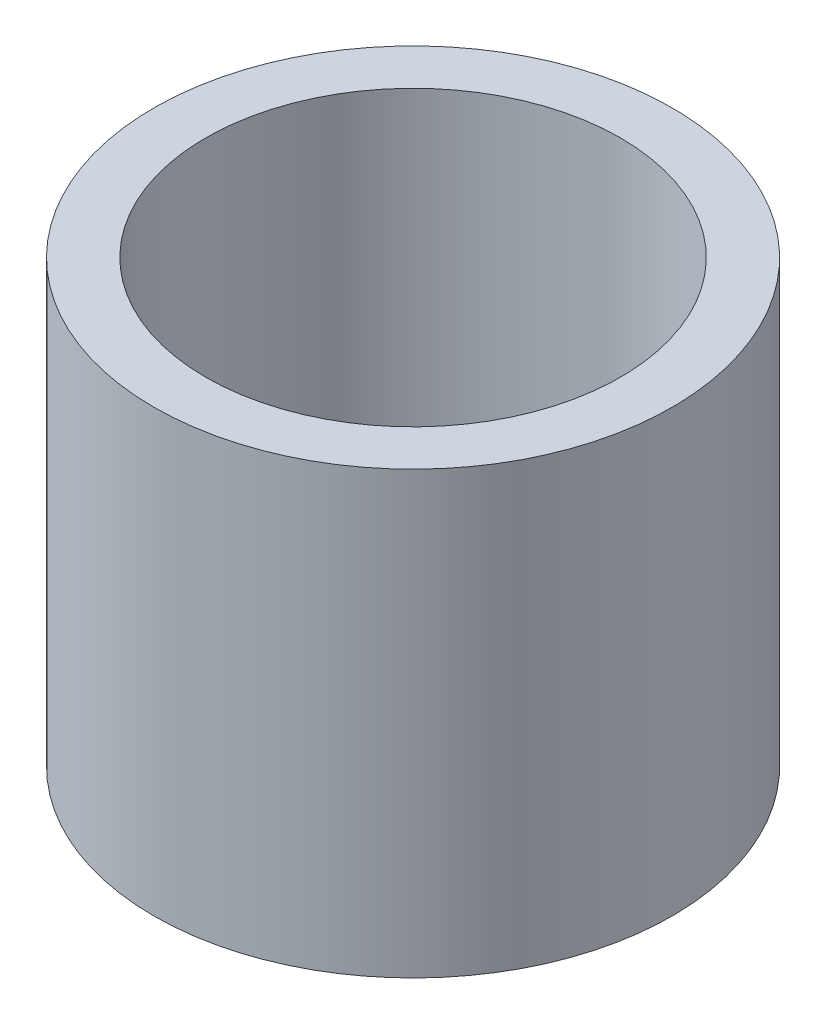
ISO-10303-21;
HEADER;
FILE_DESCRIPTION(('STEP AP214'),'2;1');
FILE_NAME('part.step','',(''),(''),'','','');
FILE_SCHEMA(('AUTOMOTIVE_DESIGN { 1 0 10303 214 1 1 1 1 }'));
ENDSEC;
DATA;
#1=APPLICATION_CONTEXT('core data for automotive mechanical design processes');
#2=APPLICATION_PROTOCOL_DEFINITION('international standard','automotive_design',2000,#1);
#3=PRODUCT_CONTEXT('',#1,'mechanical');
#4=PRODUCT('Part','Part','',(#3));
#5=PRODUCT_RELATED_PRODUCT_CATEGORY('part','',(#4));
#6=PRODUCT_DEFINITION_FORMATION('','',#4);
#7=PRODUCT_DEFINITION_CONTEXT('part definition',#1,'design');
#8=PRODUCT_DEFINITION('design','',#6,#7);
#9=PRODUCT_DEFINITION_SHAPE('','',#8);
#10=(LENGTH_UNIT() NAMED_UNIT(*) SI_UNIT(.MILLI.,.METRE.));
#11=(NAMED_UNIT(*) PLANE_ANGLE_UNIT() SI_UNIT($,.RADIAN.));
#12=(NAMED_UNIT(*) SI_UNIT($,.STERADIAN.) SOLID_ANGLE_UNIT());
#13=UNCERTAINTY_MEASURE_WITH_UNIT(LENGTH_MEASURE(1.E-05),#10,'distance_accuracy_value','');
#14=(GEOMETRIC_REPRESENTATION_CONTEXT(3) GLOBAL_UNCERTAINTY_ASSIGNED_CONTEXT((#13)) GLOBAL_UNIT_ASSIGNED_CONTEXT((#10,
#11,#12)) REPRESENTATION_CONTEXT('',''));
#15=CARTESIAN_POINT('',(0.,0.,0.));
#16=DIRECTION('',(0.,0.,1.));
#17=DIRECTION('',(1.,0.,0.));
#18=AXIS2_PLACEMENT_3D('',#15,#16,#17);
#19=CARTESIAN_POINT('',(0.,17.,0.));
#20=DIRECTION('',(0.,1.,0.));
#21=DIRECTION('',(0.,0.,1.));
#22=AXIS2_PLACEMENT_3D('',#19,#20,#21);
#23=PLANE('',#22);
#24=CARTESIAN_POINT('',(0.,17.,0.));
#25=DIRECTION('',(0.,1.,0.));
#26=DIRECTION('',(0.,0.,1.));
#27=AXIS2_PLACEMENT_3D('',#24,#25,#26);
#28=CIRCLE('',#27,20.);
#29=CARTESIAN_POINT('',(0.,17.,20.));
#30=VERTEX_POINT('',#29);
#31=EDGE_CURVE('E12',#30,#30,#28,.T.);
#32=ORIENTED_EDGE('',*,*,#31,.T.);
#33=EDGE_LOOP('',(#32));
#34=FACE_BOUND('',#33,.T.);
#35=CARTESIAN_POINT('',(0.,17.,0.));
#36=DIRECTION('',(0.,1.,0.));
#37=DIRECTION('',(0.,0.,1.));
#38=AXIS2_PLACEMENT_3D('',#35,#36,#37);
#39=CIRCLE('',#38,16.);
#40=CARTESIAN_POINT('',(0.,17.,16.));
#41=VERTEX_POINT('',#40);
#42=EDGE_CURVE('E58',#41,#41,#39,.T.);
#43=ORIENTED_EDGE('',*,*,#42,.F.);
#44=EDGE_LOOP('',(#43));
#45=FACE_BOUND('',#44,.T.);
#46=ADVANCED_FACE('F44',(#34,#45),#23,.T.);
#47=CARTESIAN_POINT('',(0.,-17.,0.));
#48=DIRECTION('',(0.,1.,0.));
#49=DIRECTION('',(0.,0.,1.));
#50=AXIS2_PLACEMENT_3D('',#47,#48,#49);
#51=PLANE('',#50);
#52=CARTESIAN_POINT('',(0.,-17.,0.));
#53=DIRECTION('',(0.,1.,0.));
#54=DIRECTION('',(0.,0.,1.));
#55=AXIS2_PLACEMENT_3D('',#52,#53,#54);
#56=CIRCLE('',#55,20.);
#57=CARTESIAN_POINT('',(0.,-17.,20.));
#58=VERTEX_POINT('',#57);
#59=EDGE_CURVE('E48',#58,#58,#56,.T.);
#60=ORIENTED_EDGE('',*,*,#59,.F.);
#61=EDGE_LOOP('',(#60));
#62=FACE_BOUND('',#61,.T.);
#63=CARTESIAN_POINT('',(0.,-17.,0.));
#64=DIRECTION('',(0.,1.,0.));
#65=DIRECTION('',(0.,0.,1.));
#66=AXIS2_PLACEMENT_3D('',#63,#64,#65);
#67=CIRCLE('',#66,16.);
#68=CARTESIAN_POINT('',(0.,-17.,16.));
#69=VERTEX_POINT('',#68);
#70=EDGE_CURVE('E60',#69,#69,#67,.T.);
#71=ORIENTED_EDGE('',*,*,#70,.T.);
#72=EDGE_LOOP('',(#71));
#73=FACE_BOUND('',#72,.T.);
#74=ADVANCED_FACE('F73',(#62,#73),#51,.F.);
#75=CARTESIAN_POINT('',(0.,17.,0.));
#76=DIRECTION('',(0.,-1.,0.));
#77=DIRECTION('',(0.,0.,-1.));
#78=AXIS2_PLACEMENT_3D('',#75,#76,#77);
#79=CYLINDRICAL_SURFACE('',#78,20.);
#80=ORIENTED_EDGE('',*,*,#31,.F.);
#81=EDGE_LOOP('',(#80));
#82=FACE_BOUND('',#81,.T.);
#83=ORIENTED_EDGE('',*,*,#59,.T.);
#84=EDGE_LOOP('',(#83));
#85=FACE_BOUND('',#84,.T.);
#86=ADVANCED_FACE('F46',(#82,#85),#79,.T.);
#87=CARTESIAN_POINT('',(0.,17.,0.));
#88=DIRECTION('',(0.,-1.,0.));
#89=DIRECTION('',(0.,0.,-1.));
#90=AXIS2_PLACEMENT_3D('',#87,#88,#89);
#91=CYLINDRICAL_SURFACE('',#90,16.);
#92=ORIENTED_EDGE('',*,*,#42,.T.);
#93=EDGE_LOOP('',(#92));
#94=FACE_BOUND('',#93,.T.);
#95=ORIENTED_EDGE('',*,*,#70,.F.);
#96=EDGE_LOOP('',(#95));
#97=FACE_BOUND('',#96,.T.);
#98=ADVANCED_FACE('F69',(#94,#97),#91,.F.);
#99=CLOSED_SHELL('',(#46,#74,#86,#98));
#100=MANIFOLD_SOLID_BREP('B2',#99);
#101=ADVANCED_BREP_SHAPE_REPRESENTATION('',(#18,#100),#14);
#102=SHAPE_DEFINITION_REPRESENTATION(#9,#101);
ENDSEC;
END-ISO-10303-21;
